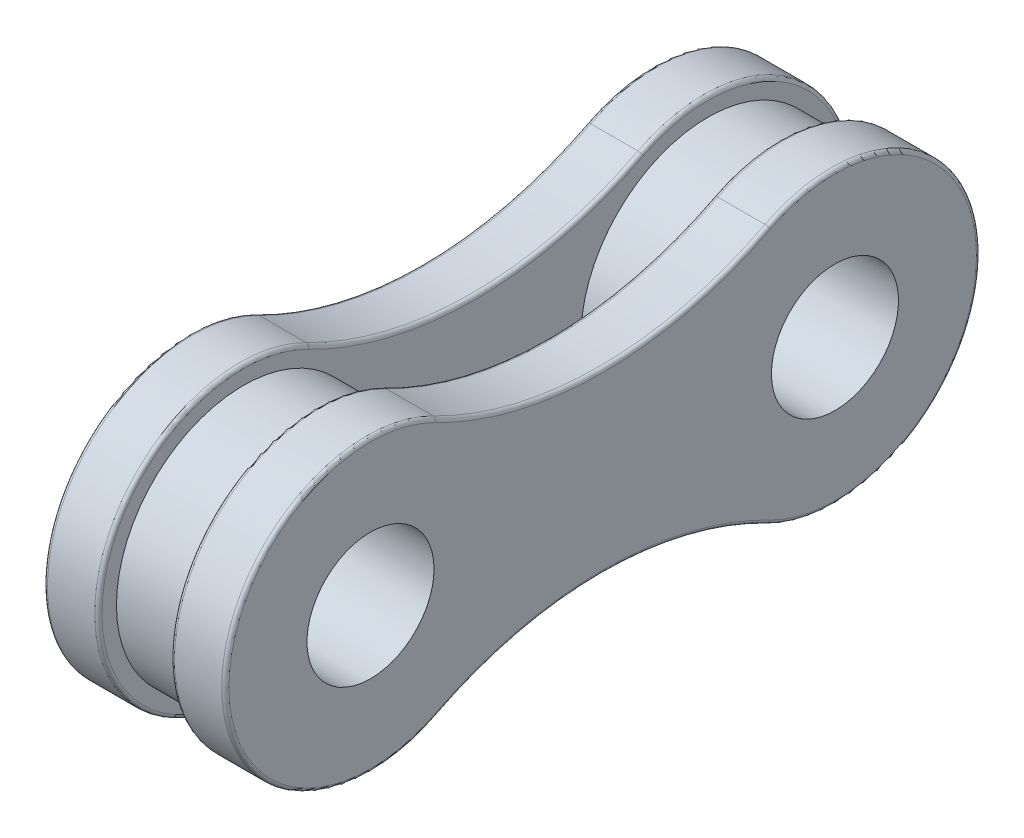
ISO-10303-21;
HEADER;
FILE_DESCRIPTION(('STEP AP214'),'2;1');
FILE_NAME('part.step','',(''),(''),'','','');
FILE_SCHEMA(('AUTOMOTIVE_DESIGN { 1 0 10303 214 1 1 1 1 }'));
ENDSEC;
DATA;
#1=APPLICATION_CONTEXT('core data for automotive mechanical design processes');
#2=APPLICATION_PROTOCOL_DEFINITION('international standard','automotive_design',2000,#1);
#3=PRODUCT_CONTEXT('',#1,'mechanical');
#4=PRODUCT('Part','Part','',(#3));
#5=PRODUCT_RELATED_PRODUCT_CATEGORY('part','',(#4));
#6=PRODUCT_DEFINITION_FORMATION('','',#4);
#7=PRODUCT_DEFINITION_CONTEXT('part definition',#1,'design');
#8=PRODUCT_DEFINITION('design','',#6,#7);
#9=PRODUCT_DEFINITION_SHAPE('','',#8);
#10=(LENGTH_UNIT() NAMED_UNIT(*) SI_UNIT(.MILLI.,.METRE.));
#11=(NAMED_UNIT(*) PLANE_ANGLE_UNIT() SI_UNIT($,.RADIAN.));
#12=(NAMED_UNIT(*) SI_UNIT($,.STERADIAN.) SOLID_ANGLE_UNIT());
#13=UNCERTAINTY_MEASURE_WITH_UNIT(LENGTH_MEASURE(1.E-05),#10,'distance_accuracy_value','');
#14=(GEOMETRIC_REPRESENTATION_CONTEXT(3) GLOBAL_UNCERTAINTY_ASSIGNED_CONTEXT((#13)) GLOBAL_UNIT_ASSIGNED_CONTEXT((#10,
#11,#12)) REPRESENTATION_CONTEXT('',''));
#15=CARTESIAN_POINT('',(0.,0.,0.));
#16=DIRECTION('',(0.,0.,1.));
#17=DIRECTION('',(1.,0.,0.));
#18=AXIS2_PLACEMENT_3D('',#15,#16,#17);
#19=CARTESIAN_POINT('',(1.,-6.2261384049425,-3.19925));
#20=DIRECTION('',(-1.,0.,0.));
#21=DIRECTION('',(0.,0.,1.));
#22=AXIS2_PLACEMENT_3D('',#19,#20,#21);
#23=PLANE('',#22);
#24=CARTESIAN_POINT('',(1.,12.452276809885,0.));
#25=DIRECTION('',(-1.,0.,0.));
#26=DIRECTION('',(0.,0.,1.));
#27=AXIS2_PLACEMENT_3D('',#24,#25,#26);
#28=CIRCLE('',#27,10.1);
#29=CARTESIAN_POINT('',(1.,3.46884853989654,4.61606071428572));
#30=VERTEX_POINT('',#29);
#31=CARTESIAN_POINT('',(1.,3.46884853989654,-4.61606071428571));
#32=VERTEX_POINT('',#31);
#33=EDGE_CURVE('E294',#30,#32,#28,.F.);
#34=ORIENTED_EDGE('',*,*,#33,.T.);
#35=CARTESIAN_POINT('',(1.,0.,-6.3985));
#36=DIRECTION('',(-1.,0.,0.));
#37=DIRECTION('',(0.,0.,1.));
#38=AXIS2_PLACEMENT_3D('',#35,#36,#37);
#39=CIRCLE('',#38,3.9);
#40=CARTESIAN_POINT('',(1.,-3.46884853989654,-4.61606071428572));
#41=VERTEX_POINT('',#40);
#42=EDGE_CURVE('E300',#32,#41,#39,.T.);
#43=ORIENTED_EDGE('',*,*,#42,.T.);
#44=CARTESIAN_POINT('',(1.,-12.452276809885,0.));
#45=DIRECTION('',(-1.,0.,0.));
#46=DIRECTION('',(0.,0.,1.));
#47=AXIS2_PLACEMENT_3D('',#44,#45,#46);
#48=CIRCLE('',#47,10.1);
#49=CARTESIAN_POINT('',(1.,-3.46884853989654,4.61606071428572));
#50=VERTEX_POINT('',#49);
#51=EDGE_CURVE('E298',#41,#50,#48,.F.);
#52=ORIENTED_EDGE('',*,*,#51,.T.);
#53=CARTESIAN_POINT('',(1.,0.,6.3985));
#54=DIRECTION('',(-1.,0.,0.));
#55=DIRECTION('',(0.,0.,1.));
#56=AXIS2_PLACEMENT_3D('',#53,#54,#55);
#57=CIRCLE('',#56,3.9);
#58=EDGE_CURVE('E296',#50,#30,#57,.T.);
#59=ORIENTED_EDGE('',*,*,#58,.T.);
#60=EDGE_LOOP('',(#34,#43,#52,#59));
#61=FACE_BOUND('',#60,.T.);
#62=CARTESIAN_POINT('',(1.,0.,-6.3985));
#63=DIRECTION('',(1.,0.,0.));
#64=DIRECTION('',(0.,0.,-1.));
#65=AXIS2_PLACEMENT_3D('',#62,#63,#64);
#66=CIRCLE('',#65,3.49999999999983);
#67=CARTESIAN_POINT('',(1.,0.,-9.89849999999984));
#68=VERTEX_POINT('',#67);
#69=EDGE_CURVE('E277',#68,#68,#66,.T.);
#70=ORIENTED_EDGE('',*,*,#69,.T.);
#71=EDGE_LOOP('',(#70));
#72=FACE_BOUND('',#71,.T.);
#73=CARTESIAN_POINT('',(1.,0.,6.3985));
#74=DIRECTION('',(1.,0.,0.));
#75=DIRECTION('',(0.,0.,1.));
#76=AXIS2_PLACEMENT_3D('',#73,#74,#75);
#77=CIRCLE('',#76,3.49999999999984);
#78=CARTESIAN_POINT('',(1.,0.,9.89849999999984));
#79=VERTEX_POINT('',#78);
#80=EDGE_CURVE('E251',#79,#79,#77,.T.);
#81=ORIENTED_EDGE('',*,*,#80,.T.);
#82=EDGE_LOOP('',(#81));
#83=FACE_BOUND('',#82,.T.);
#84=ADVANCED_FACE('F32',(#61,#72,#83),#23,.T.);
#85=CARTESIAN_POINT('',(-1.,6.22613840494251,-3.19925));
#86=DIRECTION('',(1.,0.,0.));
#87=DIRECTION('',(0.,0.,-1.));
#88=AXIS2_PLACEMENT_3D('',#85,#86,#87);
#89=PLANE('',#88);
#90=CARTESIAN_POINT('',(-1.,12.452276809885,0.));
#91=DIRECTION('',(1.,0.,0.));
#92=DIRECTION('',(0.,0.,-1.));
#93=AXIS2_PLACEMENT_3D('',#90,#91,#92);
#94=CIRCLE('',#93,10.1);
#95=CARTESIAN_POINT('',(-1.,3.46884853989654,-4.61606071428571));
#96=VERTEX_POINT('',#95);
#97=CARTESIAN_POINT('',(-1.,3.46884853989654,4.61606071428572));
#98=VERTEX_POINT('',#97);
#99=EDGE_CURVE('E322',#96,#98,#94,.F.);
#100=ORIENTED_EDGE('',*,*,#99,.T.);
#101=CARTESIAN_POINT('',(-1.,0.,6.3985));
#102=DIRECTION('',(1.,0.,0.));
#103=DIRECTION('',(0.,0.,-1.));
#104=AXIS2_PLACEMENT_3D('',#101,#102,#103);
#105=CIRCLE('',#104,3.9);
#106=CARTESIAN_POINT('',(-1.,-3.46884853989654,4.61606071428571));
#107=VERTEX_POINT('',#106);
#108=EDGE_CURVE('E324',#98,#107,#105,.T.);
#109=ORIENTED_EDGE('',*,*,#108,.T.);
#110=CARTESIAN_POINT('',(-1.,-12.452276809885,0.));
#111=DIRECTION('',(1.,0.,0.));
#112=DIRECTION('',(0.,0.,-1.));
#113=AXIS2_PLACEMENT_3D('',#110,#111,#112);
#114=CIRCLE('',#113,10.1);
#115=CARTESIAN_POINT('',(-1.,-3.46884853989654,-4.61606071428571));
#116=VERTEX_POINT('',#115);
#117=EDGE_CURVE('E318',#107,#116,#114,.F.);
#118=ORIENTED_EDGE('',*,*,#117,.T.);
#119=CARTESIAN_POINT('',(-1.,0.,-6.3985));
#120=DIRECTION('',(1.,0.,0.));
#121=DIRECTION('',(0.,0.,-1.));
#122=AXIS2_PLACEMENT_3D('',#119,#120,#121);
#123=CIRCLE('',#122,3.9);
#124=EDGE_CURVE('E320',#116,#96,#123,.T.);
#125=ORIENTED_EDGE('',*,*,#124,.T.);
#126=EDGE_LOOP('',(#100,#109,#118,#125));
#127=FACE_BOUND('',#126,.T.);
#128=CARTESIAN_POINT('',(-1.,0.,-6.3985));
#129=DIRECTION('',(1.,0.,0.));
#130=DIRECTION('',(0.,0.,-1.));
#131=AXIS2_PLACEMENT_3D('',#128,#129,#130);
#132=CIRCLE('',#131,3.49999999999983);
#133=CARTESIAN_POINT('',(-1.,0.,-9.89849999999984));
#134=VERTEX_POINT('',#133);
#135=EDGE_CURVE('E268',#134,#134,#132,.T.);
#136=ORIENTED_EDGE('',*,*,#135,.F.);
#137=EDGE_LOOP('',(#136));
#138=FACE_BOUND('',#137,.T.);
#139=CARTESIAN_POINT('',(-1.,0.,6.3985));
#140=DIRECTION('',(1.,0.,0.));
#141=DIRECTION('',(0.,0.,1.));
#142=AXIS2_PLACEMENT_3D('',#139,#140,#141);
#143=CIRCLE('',#142,3.49999999999984);
#144=CARTESIAN_POINT('',(-1.,0.,9.89849999999984));
#145=VERTEX_POINT('',#144);
#146=EDGE_CURVE('E245',#145,#145,#143,.T.);
#147=ORIENTED_EDGE('',*,*,#146,.F.);
#148=EDGE_LOOP('',(#147));
#149=FACE_BOUND('',#148,.T.);
#150=ADVANCED_FACE('F369',(#127,#138,#149),#89,.T.);
#151=CARTESIAN_POINT('',(2.5,-6.2261384049425,-3.19925));
#152=DIRECTION('',(-1.,0.,0.));
#153=DIRECTION('',(0.,0.,1.));
#154=AXIS2_PLACEMENT_3D('',#151,#152,#153);
#155=PLANE('',#154);
#156=CARTESIAN_POINT('',(2.5,-12.452276809885,0.));
#157=DIRECTION('',(-1.,0.,0.));
#158=DIRECTION('',(0.,0.,1.));
#159=AXIS2_PLACEMENT_3D('',#156,#157,#158);
#160=CIRCLE('',#159,10.1);
#161=CARTESIAN_POINT('',(2.5,-3.46884853989654,4.61606071428572));
#162=VERTEX_POINT('',#161);
#163=CARTESIAN_POINT('',(2.5,-3.46884853989654,-4.61606071428572));
#164=VERTEX_POINT('',#163);
#165=EDGE_CURVE('E314',#162,#164,#160,.T.);
#166=ORIENTED_EDGE('',*,*,#165,.T.);
#167=CARTESIAN_POINT('',(2.5,0.,-6.3985));
#168=DIRECTION('',(-1.,0.,0.));
#169=DIRECTION('',(0.,0.,1.));
#170=AXIS2_PLACEMENT_3D('',#167,#168,#169);
#171=CIRCLE('',#170,3.9);
#172=CARTESIAN_POINT('',(2.5,3.46884853989654,-4.61606071428571));
#173=VERTEX_POINT('',#172);
#174=EDGE_CURVE('E316',#164,#173,#171,.F.);
#175=ORIENTED_EDGE('',*,*,#174,.T.);
#176=CARTESIAN_POINT('',(2.5,12.452276809885,0.));
#177=DIRECTION('',(-1.,0.,0.));
#178=DIRECTION('',(0.,0.,1.));
#179=AXIS2_PLACEMENT_3D('',#176,#177,#178);
#180=CIRCLE('',#179,10.1);
#181=CARTESIAN_POINT('',(2.5,3.46884853989654,4.61606071428572));
#182=VERTEX_POINT('',#181);
#183=EDGE_CURVE('E184',#173,#182,#180,.T.);
#184=ORIENTED_EDGE('',*,*,#183,.T.);
#185=CARTESIAN_POINT('',(2.5,0.,6.3985));
#186=DIRECTION('',(-1.,0.,0.));
#187=DIRECTION('',(0.,0.,1.));
#188=AXIS2_PLACEMENT_3D('',#185,#186,#187);
#189=CIRCLE('',#188,3.9);
#190=EDGE_CURVE('E312',#182,#162,#189,.F.);
#191=ORIENTED_EDGE('',*,*,#190,.T.);
#192=EDGE_LOOP('',(#166,#175,#184,#191));
#193=FACE_BOUND('',#192,.T.);
#194=CARTESIAN_POINT('',(2.5,0.,6.3985));
#195=DIRECTION('',(1.,0.,0.));
#196=DIRECTION('',(0.,0.,-1.));
#197=AXIS2_PLACEMENT_3D('',#194,#195,#196);
#198=CIRCLE('',#197,1.74999999999992);
#199=CARTESIAN_POINT('',(2.5,0.,4.64850000000008));
#200=VERTEX_POINT('',#199);
#201=EDGE_CURVE('E285',#200,#200,#198,.T.);
#202=ORIENTED_EDGE('',*,*,#201,.F.);
#203=EDGE_LOOP('',(#202));
#204=FACE_BOUND('',#203,.T.);
#205=CARTESIAN_POINT('',(2.5,0.,-6.3985));
#206=DIRECTION('',(1.,0.,0.));
#207=DIRECTION('',(0.,0.,1.));
#208=AXIS2_PLACEMENT_3D('',#205,#206,#207);
#209=CIRCLE('',#208,1.74999999999992);
#210=CARTESIAN_POINT('',(2.5,0.,-4.64850000000008));
#211=VERTEX_POINT('',#210);
#212=EDGE_CURVE('E280',#211,#211,#209,.T.);
#213=ORIENTED_EDGE('',*,*,#212,.F.);
#214=EDGE_LOOP('',(#213));
#215=FACE_BOUND('',#214,.T.);
#216=ADVANCED_FACE('F372',(#193,#204,#215),#155,.F.);
#217=CARTESIAN_POINT('',(2.5,-12.452276809885,0.));
#218=DIRECTION('',(-1.,0.,0.));
#219=DIRECTION('',(0.,0.,1.));
#220=AXIS2_PLACEMENT_3D('',#217,#218,#219);
#221=CYLINDRICAL_SURFACE('',#220,10.);
#222=DIRECTION('',(-1.,0.,0.));
#223=VECTOR('',#222,1.);
#224=CARTESIAN_POINT('',(2.5,-3.55779337425286,4.57035714285715));
#225=LINE('',#224,#223);
#226=CARTESIAN_POINT('',(2.4,-3.55779337425286,4.57035714285715));
#227=VERTEX_POINT('',#226);
#228=CARTESIAN_POINT('',(1.1,-3.55779337425286,4.57035714285715));
#229=VERTEX_POINT('',#228);
#230=EDGE_CURVE('E288',#227,#229,#225,.T.);
#231=ORIENTED_EDGE('',*,*,#230,.T.);
#232=CARTESIAN_POINT('',(1.1,-12.452276809885,0.));
#233=DIRECTION('',(-1.,0.,0.));
#234=DIRECTION('',(0.,0.,1.));
#235=AXIS2_PLACEMENT_3D('',#232,#233,#234);
#236=CIRCLE('',#235,10.);
#237=CARTESIAN_POINT('',(1.1,-3.55779337425286,-4.57035714285715));
#238=VERTEX_POINT('',#237);
#239=EDGE_CURVE('E305',#229,#238,#236,.T.);
#240=ORIENTED_EDGE('',*,*,#239,.T.);
#241=DIRECTION('',(-1.,0.,0.));
#242=VECTOR('',#241,1.);
#243=CARTESIAN_POINT('',(2.5,-3.55779337425286,-4.57035714285715));
#244=LINE('',#243,#242);
#245=CARTESIAN_POINT('',(2.4,-3.55779337425286,-4.57035714285715));
#246=VERTEX_POINT('',#245);
#247=EDGE_CURVE('E172',#246,#238,#244,.T.);
#248=ORIENTED_EDGE('',*,*,#247,.F.);
#249=CARTESIAN_POINT('',(2.4,-12.452276809885,0.));
#250=DIRECTION('',(-1.,0.,0.));
#251=DIRECTION('',(0.,0.,1.));
#252=AXIS2_PLACEMENT_3D('',#249,#250,#251);
#253=CIRCLE('',#252,10.);
#254=EDGE_CURVE('E303',#246,#227,#253,.F.);
#255=ORIENTED_EDGE('',*,*,#254,.T.);
#256=EDGE_LOOP('',(#231,#240,#248,#255));
#257=FACE_BOUND('',#256,.T.);
#258=ADVANCED_FACE('F408',(#257),#221,.F.);
#259=CARTESIAN_POINT('',(2.5,0.,-6.3985));
#260=DIRECTION('',(-1.,0.,0.));
#261=DIRECTION('',(0.,0.,1.));
#262=AXIS2_PLACEMENT_3D('',#259,#260,#261);
#263=CYLINDRICAL_SURFACE('',#262,4.);
#264=ORIENTED_EDGE('',*,*,#247,.T.);
#265=CARTESIAN_POINT('',(1.1,0.,-6.3985));
#266=DIRECTION('',(-1.,0.,0.));
#267=DIRECTION('',(0.,0.,1.));
#268=AXIS2_PLACEMENT_3D('',#265,#266,#267);
#269=CIRCLE('',#268,4.);
#270=CARTESIAN_POINT('',(1.1,3.55779337425286,-4.57035714285714));
#271=VERTEX_POINT('',#270);
#272=EDGE_CURVE('E171',#238,#271,#269,.F.);
#273=ORIENTED_EDGE('',*,*,#272,.T.);
#274=DIRECTION('',(-1.,0.,0.));
#275=VECTOR('',#274,1.);
#276=CARTESIAN_POINT('',(2.5,3.55779337425286,-4.57035714285714));
#277=LINE('',#276,#275);
#278=CARTESIAN_POINT('',(2.4,3.55779337425286,-4.57035714285714));
#279=VERTEX_POINT('',#278);
#280=EDGE_CURVE('E152',#279,#271,#277,.T.);
#281=ORIENTED_EDGE('',*,*,#280,.F.);
#282=CARTESIAN_POINT('',(2.4,0.,-6.3985));
#283=DIRECTION('',(-1.,0.,0.));
#284=DIRECTION('',(0.,0.,1.));
#285=AXIS2_PLACEMENT_3D('',#282,#283,#284);
#286=CIRCLE('',#285,4.);
#287=EDGE_CURVE('E168',#279,#246,#286,.T.);
#288=ORIENTED_EDGE('',*,*,#287,.T.);
#289=EDGE_LOOP('',(#264,#273,#281,#288));
#290=FACE_BOUND('',#289,.T.);
#291=ADVANCED_FACE('F167',(#290),#263,.T.);
#292=CARTESIAN_POINT('',(2.5,12.452276809885,0.));
#293=DIRECTION('',(-1.,0.,0.));
#294=DIRECTION('',(0.,0.,1.));
#295=AXIS2_PLACEMENT_3D('',#292,#293,#294);
#296=CYLINDRICAL_SURFACE('',#295,10.);
#297=ORIENTED_EDGE('',*,*,#280,.T.);
#298=CARTESIAN_POINT('',(1.1,12.452276809885,0.));
#299=DIRECTION('',(-1.,0.,0.));
#300=DIRECTION('',(0.,0.,1.));
#301=AXIS2_PLACEMENT_3D('',#298,#299,#300);
#302=CIRCLE('',#301,10.);
#303=CARTESIAN_POINT('',(1.1,3.55779337425286,4.57035714285714));
#304=VERTEX_POINT('',#303);
#305=EDGE_CURVE('E159',#271,#304,#302,.T.);
#306=ORIENTED_EDGE('',*,*,#305,.T.);
#307=DIRECTION('',(-1.,0.,0.));
#308=VECTOR('',#307,1.);
#309=CARTESIAN_POINT('',(2.5,3.55779337425286,4.57035714285714));
#310=LINE('',#309,#308);
#311=CARTESIAN_POINT('',(2.4,3.55779337425286,4.57035714285714));
#312=VERTEX_POINT('',#311);
#313=EDGE_CURVE('E154',#312,#304,#310,.T.);
#314=ORIENTED_EDGE('',*,*,#313,.F.);
#315=CARTESIAN_POINT('',(2.4,12.452276809885,0.));
#316=DIRECTION('',(-1.,0.,0.));
#317=DIRECTION('',(0.,0.,1.));
#318=AXIS2_PLACEMENT_3D('',#315,#316,#317);
#319=CIRCLE('',#318,10.);
#320=EDGE_CURVE('E149',#312,#279,#319,.F.);
#321=ORIENTED_EDGE('',*,*,#320,.T.);
#322=EDGE_LOOP('',(#297,#306,#314,#321));
#323=FACE_BOUND('',#322,.T.);
#324=ADVANCED_FACE('F151',(#323),#296,.F.);
#325=CARTESIAN_POINT('',(2.5,0.,6.3985));
#326=DIRECTION('',(-1.,0.,0.));
#327=DIRECTION('',(0.,0.,1.));
#328=AXIS2_PLACEMENT_3D('',#325,#326,#327);
#329=CYLINDRICAL_SURFACE('',#328,4.);
#330=ORIENTED_EDGE('',*,*,#313,.T.);
#331=CARTESIAN_POINT('',(1.1,0.,6.3985));
#332=DIRECTION('',(-1.,0.,0.));
#333=DIRECTION('',(0.,0.,1.));
#334=AXIS2_PLACEMENT_3D('',#331,#332,#333);
#335=CIRCLE('',#334,4.);
#336=EDGE_CURVE('E309',#304,#229,#335,.F.);
#337=ORIENTED_EDGE('',*,*,#336,.T.);
#338=ORIENTED_EDGE('',*,*,#230,.F.);
#339=CARTESIAN_POINT('',(2.4,0.,6.3985));
#340=DIRECTION('',(-1.,0.,0.));
#341=DIRECTION('',(0.,0.,1.));
#342=AXIS2_PLACEMENT_3D('',#339,#340,#341);
#343=CIRCLE('',#342,4.);
#344=EDGE_CURVE('E307',#227,#312,#343,.T.);
#345=ORIENTED_EDGE('',*,*,#344,.T.);
#346=EDGE_LOOP('',(#330,#337,#338,#345));
#347=FACE_BOUND('',#346,.T.);
#348=ADVANCED_FACE('F400',(#347),#329,.T.);
#349=CARTESIAN_POINT('',(2.5,0.,6.3985));
#350=DIRECTION('',(-1.,0.,0.));
#351=DIRECTION('',(0.,0.,1.));
#352=AXIS2_PLACEMENT_3D('',#349,#350,#351);
#353=CYLINDRICAL_SURFACE('',#352,1.74999999999992);
#354=ORIENTED_EDGE('',*,*,#201,.T.);
#355=EDGE_LOOP('',(#354));
#356=FACE_BOUND('',#355,.T.);
#357=CARTESIAN_POINT('',(-2.5,0.,6.3985));
#358=DIRECTION('',(1.,0.,0.));
#359=DIRECTION('',(0.,0.,-1.));
#360=AXIS2_PLACEMENT_3D('',#357,#358,#359);
#361=CIRCLE('',#360,1.74999999999992);
#362=CARTESIAN_POINT('',(-2.5,0.,4.64850000000008));
#363=VERTEX_POINT('',#362);
#364=EDGE_CURVE('E261',#363,#363,#361,.T.);
#365=ORIENTED_EDGE('',*,*,#364,.F.);
#366=EDGE_LOOP('',(#365));
#367=FACE_BOUND('',#366,.T.);
#368=ADVANCED_FACE('F387',(#356,#367),#353,.F.);
#369=CARTESIAN_POINT('',(2.5,0.,-6.3985));
#370=DIRECTION('',(-1.,0.,0.));
#371=DIRECTION('',(0.,0.,1.));
#372=AXIS2_PLACEMENT_3D('',#369,#370,#371);
#373=CYLINDRICAL_SURFACE('',#372,1.74999999999992);
#374=ORIENTED_EDGE('',*,*,#212,.T.);
#375=EDGE_LOOP('',(#374));
#376=FACE_BOUND('',#375,.T.);
#377=CARTESIAN_POINT('',(-2.5,0.,-6.3985));
#378=DIRECTION('',(1.,0.,0.));
#379=DIRECTION('',(0.,0.,-1.));
#380=AXIS2_PLACEMENT_3D('',#377,#378,#379);
#381=CIRCLE('',#380,1.74999999999992);
#382=CARTESIAN_POINT('',(-2.5,0.,-8.14849999999992));
#383=VERTEX_POINT('',#382);
#384=EDGE_CURVE('E256',#383,#383,#381,.T.);
#385=ORIENTED_EDGE('',*,*,#384,.F.);
#386=EDGE_LOOP('',(#385));
#387=FACE_BOUND('',#386,.T.);
#388=ADVANCED_FACE('F379',(#376,#387),#373,.F.);
#389=CARTESIAN_POINT('',(1.,0.,-6.3985));
#390=DIRECTION('',(-1.,0.,0.));
#391=DIRECTION('',(0.,0.,1.));
#392=AXIS2_PLACEMENT_3D('',#389,#390,#391);
#393=CYLINDRICAL_SURFACE('',#392,3.49999999999983);
#394=ORIENTED_EDGE('',*,*,#69,.F.);
#395=EDGE_LOOP('',(#394));
#396=FACE_BOUND('',#395,.T.);
#397=ORIENTED_EDGE('',*,*,#135,.T.);
#398=EDGE_LOOP('',(#397));
#399=FACE_BOUND('',#398,.T.);
#400=ADVANCED_FACE('F377',(#396,#399),#393,.T.);
#401=CARTESIAN_POINT('',(-2.5,0.,-6.3985));
#402=DIRECTION('',(1.,0.,0.));
#403=DIRECTION('',(0.,0.,-1.));
#404=AXIS2_PLACEMENT_3D('',#401,#402,#403);
#405=CYLINDRICAL_SURFACE('',#404,4.);
#406=DIRECTION('',(1.,0.,0.));
#407=VECTOR('',#406,1.);
#408=CARTESIAN_POINT('',(-2.5,3.55779337425286,-4.57035714285714));
#409=LINE('',#408,#407);
#410=CARTESIAN_POINT('',(-2.4,3.55779337425286,-4.57035714285714));
#411=VERTEX_POINT('',#410);
#412=CARTESIAN_POINT('',(-1.1,3.55779337425286,-4.57035714285714));
#413=VERTEX_POINT('',#412);
#414=EDGE_CURVE('E264',#411,#413,#409,.T.);
#415=ORIENTED_EDGE('',*,*,#414,.T.);
#416=CARTESIAN_POINT('',(-1.1,0.,-6.3985));
#417=DIRECTION('',(1.,0.,0.));
#418=DIRECTION('',(0.,0.,-1.));
#419=AXIS2_PLACEMENT_3D('',#416,#417,#418);
#420=CIRCLE('',#419,4.);
#421=CARTESIAN_POINT('',(-1.1,-3.55779337425286,-4.57035714285714));
#422=VERTEX_POINT('',#421);
#423=EDGE_CURVE('E229',#413,#422,#420,.F.);
#424=ORIENTED_EDGE('',*,*,#423,.T.);
#425=DIRECTION('',(1.,0.,0.));
#426=VECTOR('',#425,1.);
#427=CARTESIAN_POINT('',(-2.5,-3.55779337425286,-4.57035714285714));
#428=LINE('',#427,#426);
#429=CARTESIAN_POINT('',(-2.4,-3.55779337425286,-4.57035714285714));
#430=VERTEX_POINT('',#429);
#431=EDGE_CURVE('E265',#430,#422,#428,.T.);
#432=ORIENTED_EDGE('',*,*,#431,.F.);
#433=CARTESIAN_POINT('',(-2.4,0.,-6.3985));
#434=DIRECTION('',(1.,0.,0.));
#435=DIRECTION('',(0.,0.,-1.));
#436=AXIS2_PLACEMENT_3D('',#433,#434,#435);
#437=CIRCLE('',#436,4.);
#438=EDGE_CURVE('E224',#430,#411,#437,.T.);
#439=ORIENTED_EDGE('',*,*,#438,.T.);
#440=EDGE_LOOP('',(#415,#424,#432,#439));
#441=FACE_BOUND('',#440,.T.);
#442=ADVANCED_FACE('F339',(#441),#405,.T.);
#443=CARTESIAN_POINT('',(-2.5,-12.452276809885,0.));
#444=DIRECTION('',(1.,0.,0.));
#445=DIRECTION('',(0.,0.,-1.));
#446=AXIS2_PLACEMENT_3D('',#443,#444,#445);
#447=CYLINDRICAL_SURFACE('',#446,10.);
#448=ORIENTED_EDGE('',*,*,#431,.T.);
#449=CARTESIAN_POINT('',(-1.1,-12.452276809885,0.));
#450=DIRECTION('',(1.,0.,0.));
#451=DIRECTION('',(0.,0.,-1.));
#452=AXIS2_PLACEMENT_3D('',#449,#450,#451);
#453=CIRCLE('',#452,10.);
#454=CARTESIAN_POINT('',(-1.1,-3.55779337425286,4.57035714285714));
#455=VERTEX_POINT('',#454);
#456=EDGE_CURVE('E11',#422,#455,#453,.T.);
#457=ORIENTED_EDGE('',*,*,#456,.T.);
#458=DIRECTION('',(1.,0.,0.));
#459=VECTOR('',#458,1.);
#460=CARTESIAN_POINT('',(-2.5,-3.55779337425286,4.57035714285714));
#461=LINE('',#460,#459);
#462=CARTESIAN_POINT('',(-2.4,-3.55779337425286,4.57035714285714));
#463=VERTEX_POINT('',#462);
#464=EDGE_CURVE('E269',#463,#455,#461,.T.);
#465=ORIENTED_EDGE('',*,*,#464,.F.);
#466=CARTESIAN_POINT('',(-2.4,-12.452276809885,0.));
#467=DIRECTION('',(1.,0.,0.));
#468=DIRECTION('',(0.,0.,-1.));
#469=AXIS2_PLACEMENT_3D('',#466,#467,#468);
#470=CIRCLE('',#469,10.);
#471=EDGE_CURVE('E41',#463,#430,#470,.F.);
#472=ORIENTED_EDGE('',*,*,#471,.T.);
#473=EDGE_LOOP('',(#448,#457,#465,#472));
#474=FACE_BOUND('',#473,.T.);
#475=ADVANCED_FACE('F345',(#474),#447,.F.);
#476=CARTESIAN_POINT('',(-2.5,0.,6.3985));
#477=DIRECTION('',(1.,0.,0.));
#478=DIRECTION('',(0.,0.,-1.));
#479=AXIS2_PLACEMENT_3D('',#476,#477,#478);
#480=CYLINDRICAL_SURFACE('',#479,4.);
#481=ORIENTED_EDGE('',*,*,#464,.T.);
#482=CARTESIAN_POINT('',(-1.1,0.,6.3985));
#483=DIRECTION('',(1.,0.,0.));
#484=DIRECTION('',(0.,0.,-1.));
#485=AXIS2_PLACEMENT_3D('',#482,#483,#484);
#486=CIRCLE('',#485,4.);
#487=CARTESIAN_POINT('',(-1.1,3.55779337425286,4.57035714285714));
#488=VERTEX_POINT('',#487);
#489=EDGE_CURVE('E330',#455,#488,#486,.F.);
#490=ORIENTED_EDGE('',*,*,#489,.T.);
#491=DIRECTION('',(1.,0.,0.));
#492=VECTOR('',#491,1.);
#493=CARTESIAN_POINT('',(-2.5,3.55779337425286,4.57035714285714));
#494=LINE('',#493,#492);
#495=CARTESIAN_POINT('',(-2.4,3.55779337425286,4.57035714285714));
#496=VERTEX_POINT('',#495);
#497=EDGE_CURVE('E272',#496,#488,#494,.T.);
#498=ORIENTED_EDGE('',*,*,#497,.F.);
#499=CARTESIAN_POINT('',(-2.4,0.,6.3985));
#500=DIRECTION('',(1.,0.,0.));
#501=DIRECTION('',(0.,0.,-1.));
#502=AXIS2_PLACEMENT_3D('',#499,#500,#501);
#503=CIRCLE('',#502,4.);
#504=EDGE_CURVE('E327',#496,#463,#503,.T.);
#505=ORIENTED_EDGE('',*,*,#504,.T.);
#506=EDGE_LOOP('',(#481,#490,#498,#505));
#507=FACE_BOUND('',#506,.T.);
#508=ADVANCED_FACE('F362',(#507),#480,.T.);
#509=CARTESIAN_POINT('',(-2.5,12.452276809885,0.));
#510=DIRECTION('',(1.,0.,0.));
#511=DIRECTION('',(0.,0.,-1.));
#512=AXIS2_PLACEMENT_3D('',#509,#510,#511);
#513=CYLINDRICAL_SURFACE('',#512,10.);
#514=ORIENTED_EDGE('',*,*,#497,.T.);
#515=CARTESIAN_POINT('',(-1.1,12.452276809885,0.));
#516=DIRECTION('',(1.,0.,0.));
#517=DIRECTION('',(0.,0.,-1.));
#518=AXIS2_PLACEMENT_3D('',#515,#516,#517);
#519=CIRCLE('',#518,10.);
#520=EDGE_CURVE('E334',#488,#413,#519,.T.);
#521=ORIENTED_EDGE('',*,*,#520,.T.);
#522=ORIENTED_EDGE('',*,*,#414,.F.);
#523=CARTESIAN_POINT('',(-2.4,12.452276809885,0.));
#524=DIRECTION('',(1.,0.,0.));
#525=DIRECTION('',(0.,0.,-1.));
#526=AXIS2_PLACEMENT_3D('',#523,#524,#525);
#527=CIRCLE('',#526,10.);
#528=EDGE_CURVE('E221',#411,#496,#527,.F.);
#529=ORIENTED_EDGE('',*,*,#528,.T.);
#530=EDGE_LOOP('',(#514,#521,#522,#529));
#531=FACE_BOUND('',#530,.T.);
#532=ADVANCED_FACE('F364',(#531),#513,.F.);
#533=CARTESIAN_POINT('',(-2.5,6.22613840494251,-3.19925));
#534=DIRECTION('',(1.,0.,0.));
#535=DIRECTION('',(0.,0.,-1.));
#536=AXIS2_PLACEMENT_3D('',#533,#534,#535);
#537=PLANE('',#536);
#538=CARTESIAN_POINT('',(-2.5,-12.452276809885,0.));
#539=DIRECTION('',(1.,0.,0.));
#540=DIRECTION('',(0.,0.,-1.));
#541=AXIS2_PLACEMENT_3D('',#538,#539,#540);
#542=CIRCLE('',#541,10.1);
#543=CARTESIAN_POINT('',(-2.5,-3.46884853989654,-4.61606071428571));
#544=VERTEX_POINT('',#543);
#545=CARTESIAN_POINT('',(-2.5,-3.46884853989654,4.61606071428571));
#546=VERTEX_POINT('',#545);
#547=EDGE_CURVE('E226',#544,#546,#542,.T.);
#548=ORIENTED_EDGE('',*,*,#547,.T.);
#549=CARTESIAN_POINT('',(-2.5,0.,6.3985));
#550=DIRECTION('',(1.,0.,0.));
#551=DIRECTION('',(0.,0.,-1.));
#552=AXIS2_PLACEMENT_3D('',#549,#550,#551);
#553=CIRCLE('',#552,3.9);
#554=CARTESIAN_POINT('',(-2.5,3.46884853989654,4.61606071428572));
#555=VERTEX_POINT('',#554);
#556=EDGE_CURVE('E160',#546,#555,#553,.F.);
#557=ORIENTED_EDGE('',*,*,#556,.T.);
#558=CARTESIAN_POINT('',(-2.5,12.452276809885,0.));
#559=DIRECTION('',(1.,0.,0.));
#560=DIRECTION('',(0.,0.,-1.));
#561=AXIS2_PLACEMENT_3D('',#558,#559,#560);
#562=CIRCLE('',#561,10.1);
#563=CARTESIAN_POINT('',(-2.5,3.46884853989654,-4.61606071428571));
#564=VERTEX_POINT('',#563);
#565=EDGE_CURVE('E56',#555,#564,#562,.T.);
#566=ORIENTED_EDGE('',*,*,#565,.T.);
#567=CARTESIAN_POINT('',(-2.5,0.,-6.3985));
#568=DIRECTION('',(1.,0.,0.));
#569=DIRECTION('',(0.,0.,-1.));
#570=AXIS2_PLACEMENT_3D('',#567,#568,#569);
#571=CIRCLE('',#570,3.9);
#572=EDGE_CURVE('E225',#564,#544,#571,.F.);
#573=ORIENTED_EDGE('',*,*,#572,.T.);
#574=EDGE_LOOP('',(#548,#557,#566,#573));
#575=FACE_BOUND('',#574,.T.);
#576=ORIENTED_EDGE('',*,*,#384,.T.);
#577=EDGE_LOOP('',(#576));
#578=FACE_BOUND('',#577,.T.);
#579=ORIENTED_EDGE('',*,*,#364,.T.);
#580=EDGE_LOOP('',(#579));
#581=FACE_BOUND('',#580,.T.);
#582=ADVANCED_FACE('F513',(#575,#578,#581),#537,.F.);
#583=CARTESIAN_POINT('',(1.,0.,6.3985));
#584=DIRECTION('',(-1.,0.,0.));
#585=DIRECTION('',(0.,0.,1.));
#586=AXIS2_PLACEMENT_3D('',#583,#584,#585);
#587=CYLINDRICAL_SURFACE('',#586,3.49999999999984);
#588=ORIENTED_EDGE('',*,*,#80,.F.);
#589=EDGE_LOOP('',(#588));
#590=FACE_BOUND('',#589,.T.);
#591=ORIENTED_EDGE('',*,*,#146,.T.);
#592=EDGE_LOOP('',(#591));
#593=FACE_BOUND('',#592,.T.);
#594=ADVANCED_FACE('F426',(#590,#593),#587,.T.);
#595=CARTESIAN_POINT('',(1.1,0.,6.3985));
#596=DIRECTION('',(-1.,0.,0.));
#597=DIRECTION('',(0.,0.,1.));
#598=AXIS2_PLACEMENT_3D('',#595,#596,#597);
#599=TOROIDAL_SURFACE('',#598,3.9,0.1);
#600=CARTESIAN_POINT('',(1.1,3.46884853989654,4.61606071428572));
#601=DIRECTION('',(0.,-0.457035714285714,-0.889448343563215));
#602=DIRECTION('',(0.,0.889448343563215,-0.457035714285714));
#603=AXIS2_PLACEMENT_3D('',#600,#601,#602);
#604=CIRCLE('',#603,0.1);
#605=EDGE_CURVE('E238',#30,#304,#604,.T.);
#606=ORIENTED_EDGE('',*,*,#605,.F.);
#607=ORIENTED_EDGE('',*,*,#58,.F.);
#608=CARTESIAN_POINT('',(1.1,-3.46884853989654,4.61606071428572));
#609=DIRECTION('',(0.,0.457035714285714,-0.889448343563215));
#610=DIRECTION('',(0.,0.889448343563215,0.457035714285714));
#611=AXIS2_PLACEMENT_3D('',#608,#609,#610);
#612=CIRCLE('',#611,0.1);
#613=EDGE_CURVE('E194',#229,#50,#612,.T.);
#614=ORIENTED_EDGE('',*,*,#613,.F.);
#615=ORIENTED_EDGE('',*,*,#336,.F.);
#616=EDGE_LOOP('',(#606,#607,#614,#615));
#617=FACE_BOUND('',#616,.T.);
#618=ADVANCED_FACE('F423',(#617),#599,.T.);
#619=CARTESIAN_POINT('',(1.1,-12.452276809885,0.));
#620=DIRECTION('',(-1.,0.,0.));
#621=DIRECTION('',(0.,0.,1.));
#622=AXIS2_PLACEMENT_3D('',#619,#620,#621);
#623=TOROIDAL_SURFACE('',#622,10.1,0.1);
#624=ORIENTED_EDGE('',*,*,#613,.T.);
#625=ORIENTED_EDGE('',*,*,#51,.F.);
#626=CARTESIAN_POINT('',(1.1,-3.46884853989654,-4.61606071428572));
#627=DIRECTION('',(0.,-0.457035714285714,-0.889448343563215));
#628=DIRECTION('',(0.,0.889448343563215,-0.457035714285714));
#629=AXIS2_PLACEMENT_3D('',#626,#627,#628);
#630=CIRCLE('',#629,0.1);
#631=EDGE_CURVE('E237',#238,#41,#630,.T.);
#632=ORIENTED_EDGE('',*,*,#631,.F.);
#633=ORIENTED_EDGE('',*,*,#239,.F.);
#634=EDGE_LOOP('',(#624,#625,#632,#633));
#635=FACE_BOUND('',#634,.T.);
#636=ADVANCED_FACE('F420',(#635),#623,.T.);
#637=CARTESIAN_POINT('',(1.1,12.452276809885,0.));
#638=DIRECTION('',(-1.,0.,0.));
#639=DIRECTION('',(0.,0.,1.));
#640=AXIS2_PLACEMENT_3D('',#637,#638,#639);
#641=TOROIDAL_SURFACE('',#640,10.1,0.1);
#642=ORIENTED_EDGE('',*,*,#605,.T.);
#643=ORIENTED_EDGE('',*,*,#305,.F.);
#644=CARTESIAN_POINT('',(1.1,3.46884853989654,-4.61606071428571));
#645=DIRECTION('',(0.,0.457035714285715,-0.889448343563214));
#646=DIRECTION('',(0.,0.889448343563214,0.457035714285715));
#647=AXIS2_PLACEMENT_3D('',#644,#645,#646);
#648=CIRCLE('',#647,0.1);
#649=EDGE_CURVE('E201',#32,#271,#648,.T.);
#650=ORIENTED_EDGE('',*,*,#649,.F.);
#651=ORIENTED_EDGE('',*,*,#33,.F.);
#652=EDGE_LOOP('',(#642,#643,#650,#651));
#653=FACE_BOUND('',#652,.T.);
#654=ADVANCED_FACE('F416',(#653),#641,.T.);
#655=CARTESIAN_POINT('',(1.1,0.,-6.3985));
#656=DIRECTION('',(-1.,0.,0.));
#657=DIRECTION('',(0.,0.,1.));
#658=AXIS2_PLACEMENT_3D('',#655,#656,#657);
#659=TOROIDAL_SURFACE('',#658,3.9,0.1);
#660=ORIENTED_EDGE('',*,*,#631,.T.);
#661=ORIENTED_EDGE('',*,*,#42,.F.);
#662=ORIENTED_EDGE('',*,*,#649,.T.);
#663=ORIENTED_EDGE('',*,*,#272,.F.);
#664=EDGE_LOOP('',(#660,#661,#662,#663));
#665=FACE_BOUND('',#664,.T.);
#666=ADVANCED_FACE('F412',(#665),#659,.T.);
#667=CARTESIAN_POINT('',(2.4,0.,6.3985));
#668=DIRECTION('',(-1.,0.,0.));
#669=DIRECTION('',(0.,0.,1.));
#670=AXIS2_PLACEMENT_3D('',#667,#668,#669);
#671=TOROIDAL_SURFACE('',#670,3.9,0.1);
#672=CARTESIAN_POINT('',(2.4,3.46884853989654,4.61606071428572));
#673=DIRECTION('',(0.,-0.457035714285714,-0.889448343563215));
#674=DIRECTION('',(0.,0.889448343563215,-0.457035714285714));
#675=AXIS2_PLACEMENT_3D('',#672,#673,#674);
#676=CIRCLE('',#675,0.1);
#677=EDGE_CURVE('E188',#312,#182,#676,.T.);
#678=ORIENTED_EDGE('',*,*,#677,.F.);
#679=ORIENTED_EDGE('',*,*,#344,.F.);
#680=CARTESIAN_POINT('',(2.4,-3.46884853989654,4.61606071428572));
#681=DIRECTION('',(0.,0.457035714285714,-0.889448343563215));
#682=DIRECTION('',(0.,0.889448343563215,0.457035714285714));
#683=AXIS2_PLACEMENT_3D('',#680,#681,#682);
#684=CIRCLE('',#683,0.1);
#685=EDGE_CURVE('E198',#162,#227,#684,.T.);
#686=ORIENTED_EDGE('',*,*,#685,.F.);
#687=ORIENTED_EDGE('',*,*,#190,.F.);
#688=EDGE_LOOP('',(#678,#679,#686,#687));
#689=FACE_BOUND('',#688,.T.);
#690=ADVANCED_FACE('F415',(#689),#671,.T.);
#691=CARTESIAN_POINT('',(2.4,-12.452276809885,0.));
#692=DIRECTION('',(-1.,0.,0.));
#693=DIRECTION('',(0.,0.,1.));
#694=AXIS2_PLACEMENT_3D('',#691,#692,#693);
#695=TOROIDAL_SURFACE('',#694,10.1,0.1);
#696=ORIENTED_EDGE('',*,*,#685,.T.);
#697=ORIENTED_EDGE('',*,*,#254,.F.);
#698=CARTESIAN_POINT('',(2.4,-3.46884853989654,-4.61606071428572));
#699=DIRECTION('',(0.,-0.457035714285714,-0.889448343563215));
#700=DIRECTION('',(0.,0.889448343563215,-0.457035714285714));
#701=AXIS2_PLACEMENT_3D('',#698,#699,#700);
#702=CIRCLE('',#701,0.1);
#703=EDGE_CURVE('E180',#164,#246,#702,.T.);
#704=ORIENTED_EDGE('',*,*,#703,.F.);
#705=ORIENTED_EDGE('',*,*,#165,.F.);
#706=EDGE_LOOP('',(#696,#697,#704,#705));
#707=FACE_BOUND('',#706,.T.);
#708=ADVANCED_FACE('F432',(#707),#695,.T.);
#709=CARTESIAN_POINT('',(2.4,12.452276809885,0.));
#710=DIRECTION('',(-1.,0.,0.));
#711=DIRECTION('',(0.,0.,1.));
#712=AXIS2_PLACEMENT_3D('',#709,#710,#711);
#713=TOROIDAL_SURFACE('',#712,10.1,0.1);
#714=ORIENTED_EDGE('',*,*,#677,.T.);
#715=ORIENTED_EDGE('',*,*,#183,.F.);
#716=CARTESIAN_POINT('',(2.4,3.46884853989654,-4.61606071428571));
#717=DIRECTION('',(0.,0.457035714285714,-0.889448343563215));
#718=DIRECTION('',(0.,0.889448343563215,0.457035714285714));
#719=AXIS2_PLACEMENT_3D('',#716,#717,#718);
#720=CIRCLE('',#719,0.1);
#721=EDGE_CURVE('E177',#279,#173,#720,.T.);
#722=ORIENTED_EDGE('',*,*,#721,.F.);
#723=ORIENTED_EDGE('',*,*,#320,.F.);
#724=EDGE_LOOP('',(#714,#715,#722,#723));
#725=FACE_BOUND('',#724,.T.);
#726=ADVANCED_FACE('F183',(#725),#713,.T.);
#727=CARTESIAN_POINT('',(2.4,0.,-6.3985));
#728=DIRECTION('',(-1.,0.,0.));
#729=DIRECTION('',(0.,0.,1.));
#730=AXIS2_PLACEMENT_3D('',#727,#728,#729);
#731=TOROIDAL_SURFACE('',#730,3.9,0.1);
#732=ORIENTED_EDGE('',*,*,#703,.T.);
#733=ORIENTED_EDGE('',*,*,#287,.F.);
#734=ORIENTED_EDGE('',*,*,#721,.T.);
#735=ORIENTED_EDGE('',*,*,#174,.F.);
#736=EDGE_LOOP('',(#732,#733,#734,#735));
#737=FACE_BOUND('',#736,.T.);
#738=ADVANCED_FACE('F175',(#737),#731,.T.);
#739=CARTESIAN_POINT('',(-1.1,0.,-6.3985));
#740=DIRECTION('',(1.,0.,0.));
#741=DIRECTION('',(0.,0.,-1.));
#742=AXIS2_PLACEMENT_3D('',#739,#740,#741);
#743=TOROIDAL_SURFACE('',#742,3.9,0.1);
#744=CARTESIAN_POINT('',(-1.1,-3.46884853989654,-4.61606071428572));
#745=DIRECTION('',(0.,0.457035714285714,0.889448343563215));
#746=DIRECTION('',(0.,-0.889448343563215,0.457035714285714));
#747=AXIS2_PLACEMENT_3D('',#744,#745,#746);
#748=CIRCLE('',#747,0.1);
#749=EDGE_CURVE('E191',#422,#116,#748,.T.);
#750=ORIENTED_EDGE('',*,*,#749,.F.);
#751=ORIENTED_EDGE('',*,*,#423,.F.);
#752=CARTESIAN_POINT('',(-1.1,3.46884853989654,-4.61606071428571));
#753=DIRECTION('',(0.,-0.457035714285715,0.889448343563214));
#754=DIRECTION('',(0.,-0.889448343563214,-0.457035714285715));
#755=AXIS2_PLACEMENT_3D('',#752,#753,#754);
#756=CIRCLE('',#755,0.1);
#757=EDGE_CURVE('E186',#96,#413,#756,.T.);
#758=ORIENTED_EDGE('',*,*,#757,.F.);
#759=ORIENTED_EDGE('',*,*,#124,.F.);
#760=EDGE_LOOP('',(#750,#751,#758,#759));
#761=FACE_BOUND('',#760,.T.);
#762=ADVANCED_FACE('F349',(#761),#743,.T.);
#763=CARTESIAN_POINT('',(-1.1,12.452276809885,0.));
#764=DIRECTION('',(1.,0.,0.));
#765=DIRECTION('',(0.,0.,-1.));
#766=AXIS2_PLACEMENT_3D('',#763,#764,#765);
#767=TOROIDAL_SURFACE('',#766,10.1,0.1);
#768=ORIENTED_EDGE('',*,*,#757,.T.);
#769=ORIENTED_EDGE('',*,*,#520,.F.);
#770=CARTESIAN_POINT('',(-1.1,3.46884853989654,4.61606071428572));
#771=DIRECTION('',(0.,0.457035714285714,0.889448343563215));
#772=DIRECTION('',(0.,-0.889448343563215,0.457035714285714));
#773=AXIS2_PLACEMENT_3D('',#770,#771,#772);
#774=CIRCLE('',#773,0.1);
#775=EDGE_CURVE('E204',#98,#488,#774,.T.);
#776=ORIENTED_EDGE('',*,*,#775,.F.);
#777=ORIENTED_EDGE('',*,*,#99,.F.);
#778=EDGE_LOOP('',(#768,#769,#776,#777));
#779=FACE_BOUND('',#778,.T.);
#780=ADVANCED_FACE('F366',(#779),#767,.T.);
#781=CARTESIAN_POINT('',(-1.1,-12.452276809885,0.));
#782=DIRECTION('',(1.,0.,0.));
#783=DIRECTION('',(0.,0.,-1.));
#784=AXIS2_PLACEMENT_3D('',#781,#782,#783);
#785=TOROIDAL_SURFACE('',#784,10.1,0.1);
#786=ORIENTED_EDGE('',*,*,#749,.T.);
#787=ORIENTED_EDGE('',*,*,#117,.F.);
#788=CARTESIAN_POINT('',(-1.1,-3.46884853989654,4.61606071428571));
#789=DIRECTION('',(0.,-0.457035714285714,0.889448343563215));
#790=DIRECTION('',(0.,-0.889448343563215,-0.457035714285714));
#791=AXIS2_PLACEMENT_3D('',#788,#789,#790);
#792=CIRCLE('',#791,0.1);
#793=EDGE_CURVE('E202',#455,#107,#792,.T.);
#794=ORIENTED_EDGE('',*,*,#793,.F.);
#795=ORIENTED_EDGE('',*,*,#456,.F.);
#796=EDGE_LOOP('',(#786,#787,#794,#795));
#797=FACE_BOUND('',#796,.T.);
#798=ADVANCED_FACE('F353',(#797),#785,.T.);
#799=CARTESIAN_POINT('',(-1.1,0.,6.3985));
#800=DIRECTION('',(1.,0.,0.));
#801=DIRECTION('',(0.,0.,-1.));
#802=AXIS2_PLACEMENT_3D('',#799,#800,#801);
#803=TOROIDAL_SURFACE('',#802,3.9,0.1);
#804=ORIENTED_EDGE('',*,*,#775,.T.);
#805=ORIENTED_EDGE('',*,*,#489,.F.);
#806=ORIENTED_EDGE('',*,*,#793,.T.);
#807=ORIENTED_EDGE('',*,*,#108,.F.);
#808=EDGE_LOOP('',(#804,#805,#806,#807));
#809=FACE_BOUND('',#808,.T.);
#810=ADVANCED_FACE('F357',(#809),#803,.T.);
#811=CARTESIAN_POINT('',(-2.4,0.,-6.3985));
#812=DIRECTION('',(1.,0.,0.));
#813=DIRECTION('',(0.,0.,-1.));
#814=AXIS2_PLACEMENT_3D('',#811,#812,#813);
#815=TOROIDAL_SURFACE('',#814,3.9,0.1);
#816=CARTESIAN_POINT('',(-2.4,-3.46884853989654,-4.61606071428572));
#817=DIRECTION('',(0.,0.457035714285712,0.889448343563216));
#818=DIRECTION('',(0.,-0.889448343563216,0.457035714285712));
#819=AXIS2_PLACEMENT_3D('',#816,#817,#818);
#820=CIRCLE('',#819,0.1);
#821=EDGE_CURVE('E210',#544,#430,#820,.T.);
#822=ORIENTED_EDGE('',*,*,#821,.F.);
#823=ORIENTED_EDGE('',*,*,#572,.F.);
#824=CARTESIAN_POINT('',(-2.4,3.46884853989654,-4.61606071428571));
#825=DIRECTION('',(0.,-0.457035714285714,0.889448343563215));
#826=DIRECTION('',(0.,-0.889448343563215,-0.457035714285714));
#827=AXIS2_PLACEMENT_3D('',#824,#825,#826);
#828=CIRCLE('',#827,0.1);
#829=EDGE_CURVE('E36',#411,#564,#828,.T.);
#830=ORIENTED_EDGE('',*,*,#829,.F.);
#831=ORIENTED_EDGE('',*,*,#438,.F.);
#832=EDGE_LOOP('',(#822,#823,#830,#831));
#833=FACE_BOUND('',#832,.T.);
#834=ADVANCED_FACE('F34',(#833),#815,.T.);
#835=CARTESIAN_POINT('',(-2.4,12.452276809885,0.));
#836=DIRECTION('',(1.,0.,0.));
#837=DIRECTION('',(0.,0.,-1.));
#838=AXIS2_PLACEMENT_3D('',#835,#836,#837);
#839=TOROIDAL_SURFACE('',#838,10.1,0.1);
#840=ORIENTED_EDGE('',*,*,#829,.T.);
#841=ORIENTED_EDGE('',*,*,#565,.F.);
#842=CARTESIAN_POINT('',(-2.4,3.46884853989654,4.61606071428572));
#843=DIRECTION('',(0.,0.457035714285714,0.889448343563215));
#844=DIRECTION('',(0.,-0.889448343563215,0.457035714285714));
#845=AXIS2_PLACEMENT_3D('',#842,#843,#844);
#846=CIRCLE('',#845,0.1);
#847=EDGE_CURVE('E49',#496,#555,#846,.T.);
#848=ORIENTED_EDGE('',*,*,#847,.F.);
#849=ORIENTED_EDGE('',*,*,#528,.F.);
#850=EDGE_LOOP('',(#840,#841,#848,#849));
#851=FACE_BOUND('',#850,.T.);
#852=ADVANCED_FACE('F220',(#851),#839,.T.);
#853=CARTESIAN_POINT('',(-2.4,-12.452276809885,0.));
#854=DIRECTION('',(1.,0.,0.));
#855=DIRECTION('',(0.,0.,-1.));
#856=AXIS2_PLACEMENT_3D('',#853,#854,#855);
#857=TOROIDAL_SURFACE('',#856,10.1,0.1);
#858=ORIENTED_EDGE('',*,*,#821,.T.);
#859=ORIENTED_EDGE('',*,*,#471,.F.);
#860=CARTESIAN_POINT('',(-2.4,-3.46884853989654,4.61606071428571));
#861=DIRECTION('',(0.,-0.457035714285716,0.889448343563214));
#862=DIRECTION('',(0.,-0.889448343563214,-0.457035714285716));
#863=AXIS2_PLACEMENT_3D('',#860,#861,#862);
#864=CIRCLE('',#863,0.1);
#865=EDGE_CURVE('E208',#546,#463,#864,.T.);
#866=ORIENTED_EDGE('',*,*,#865,.F.);
#867=ORIENTED_EDGE('',*,*,#547,.F.);
#868=EDGE_LOOP('',(#858,#859,#866,#867));
#869=FACE_BOUND('',#868,.T.);
#870=ADVANCED_FACE('F450',(#869),#857,.T.);
#871=CARTESIAN_POINT('',(-2.4,0.,6.3985));
#872=DIRECTION('',(1.,0.,0.));
#873=DIRECTION('',(0.,0.,-1.));
#874=AXIS2_PLACEMENT_3D('',#871,#872,#873);
#875=TOROIDAL_SURFACE('',#874,3.9,0.1);
#876=ORIENTED_EDGE('',*,*,#847,.T.);
#877=ORIENTED_EDGE('',*,*,#556,.F.);
#878=ORIENTED_EDGE('',*,*,#865,.T.);
#879=ORIENTED_EDGE('',*,*,#504,.F.);
#880=EDGE_LOOP('',(#876,#877,#878,#879));
#881=FACE_BOUND('',#880,.T.);
#882=ADVANCED_FACE('F447',(#881),#875,.T.);
#883=CLOSED_SHELL('',(#84,#150,#216,#258,#291,#324,#348,#368,#388,#400,#442,#475,#508,#532,#582,
#594,#618,#636,#654,#666,#690,#708,#726,#738,#762,#780,#798,#810,#834,#852,#870,#882));
#884=MANIFOLD_SOLID_BREP('B2',#883);
#885=ADVANCED_BREP_SHAPE_REPRESENTATION('',(#18,#884),#14);
#886=SHAPE_DEFINITION_REPRESENTATION(#9,#885);
ENDSEC;
END-ISO-10303-21;
